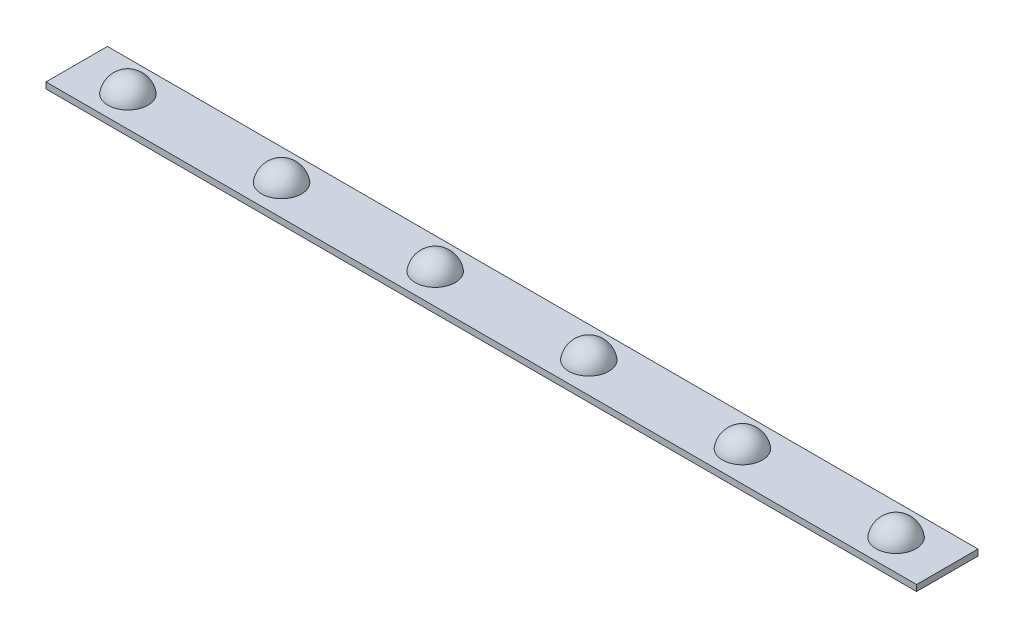
ISO-10303-21;
HEADER;
FILE_DESCRIPTION(('STEP AP214'),'2;1');
FILE_NAME('part.step','',(''),(''),'','','');
FILE_SCHEMA(('AUTOMOTIVE_DESIGN { 1 0 10303 214 1 1 1 1 }'));
ENDSEC;
DATA;
#1=APPLICATION_CONTEXT('core data for automotive mechanical design processes');
#2=APPLICATION_PROTOCOL_DEFINITION('international standard','automotive_design',2000,#1);
#3=PRODUCT_CONTEXT('',#1,'mechanical');
#4=PRODUCT('Part','Part','',(#3));
#5=PRODUCT_RELATED_PRODUCT_CATEGORY('part','',(#4));
#6=PRODUCT_DEFINITION_FORMATION('','',#4);
#7=PRODUCT_DEFINITION_CONTEXT('part definition',#1,'design');
#8=PRODUCT_DEFINITION('design','',#6,#7);
#9=PRODUCT_DEFINITION_SHAPE('','',#8);
#10=(LENGTH_UNIT() NAMED_UNIT(*) SI_UNIT(.MILLI.,.METRE.));
#11=(NAMED_UNIT(*) PLANE_ANGLE_UNIT() SI_UNIT($,.RADIAN.));
#12=(NAMED_UNIT(*) SI_UNIT($,.STERADIAN.) SOLID_ANGLE_UNIT());
#13=UNCERTAINTY_MEASURE_WITH_UNIT(LENGTH_MEASURE(1.E-05),#10,'distance_accuracy_value','');
#14=(GEOMETRIC_REPRESENTATION_CONTEXT(3) GLOBAL_UNCERTAINTY_ASSIGNED_CONTEXT((#13)) GLOBAL_UNIT_ASSIGNED_CONTEXT((#10,
#11,#12)) REPRESENTATION_CONTEXT('',''));
#15=CARTESIAN_POINT('',(0.,0.,0.));
#16=DIRECTION('',(0.,0.,1.));
#17=DIRECTION('',(1.,0.,0.));
#18=AXIS2_PLACEMENT_3D('',#15,#16,#17);
#19=CARTESIAN_POINT('',(-187.325,19.1743717494883,0.1524));
#20=DIRECTION('',(0.,1.,0.));
#21=DIRECTION('',(0.,0.,1.));
#22=AXIS2_PLACEMENT_3D('',#19,#20,#21);
#23=SPHERICAL_SURFACE('',#22,2.50880067106193);
#24=CARTESIAN_POINT('',(-187.325,19.5553717494883,0.1524));
#25=DIRECTION('',(0.,-1.,0.));
#26=DIRECTION('',(0.,0.,-1.));
#27=AXIS2_PLACEMENT_3D('',#24,#25,#26);
#28=CIRCLE('',#27,2.47970155605887);
#29=CARTESIAN_POINT('',(-187.325,19.5553717494883,-2.32730155605887));
#30=VERTEX_POINT('',#29);
#31=EDGE_CURVE('E120',#30,#30,#28,.T.);
#32=ORIENTED_EDGE('',*,*,#31,.F.);
#33=EDGE_LOOP('',(#32));
#34=FACE_BOUND('',#33,.T.);
#35=ADVANCED_FACE('F36',(#34),#23,.T.);
#36=CARTESIAN_POINT('',(-193.675,18.7933717494883,3.9624));
#37=DIRECTION('',(0.,0.,-1.));
#38=DIRECTION('',(0.,1.,0.));
#39=AXIS2_PLACEMENT_3D('',#36,#37,#38);
#40=PLANE('',#39);
#41=DIRECTION('',(1.,0.,0.));
#42=VECTOR('',#41,1.);
#43=CARTESIAN_POINT('',(-193.675,18.7933717494883,3.9624));
#44=LINE('',#43,#42);
#45=CARTESIAN_POINT('',(-193.675,18.7933717494883,3.9624));
#46=VERTEX_POINT('',#45);
#47=CARTESIAN_POINT('',(-85.725,18.7933717494883,3.9624));
#48=VERTEX_POINT('',#47);
#49=EDGE_CURVE('E100',#46,#48,#44,.T.);
#50=ORIENTED_EDGE('',*,*,#49,.T.);
#51=DIRECTION('',(0.,1.,0.));
#52=VECTOR('',#51,1.);
#53=CARTESIAN_POINT('',(-85.725,18.7933717494883,3.9624));
#54=LINE('',#53,#52);
#55=CARTESIAN_POINT('',(-85.725,19.5553717494883,3.9624));
#56=VERTEX_POINT('',#55);
#57=EDGE_CURVE('E94',#48,#56,#54,.T.);
#58=ORIENTED_EDGE('',*,*,#57,.T.);
#59=DIRECTION('',(1.,0.,0.));
#60=VECTOR('',#59,1.);
#61=CARTESIAN_POINT('',(-193.675,19.5553717494883,3.9624));
#62=LINE('',#61,#60);
#63=CARTESIAN_POINT('',(-193.675,19.5553717494883,3.9624));
#64=VERTEX_POINT('',#63);
#65=EDGE_CURVE('E77',#64,#56,#62,.T.);
#66=ORIENTED_EDGE('',*,*,#65,.F.);
#67=DIRECTION('',(0.,1.,0.));
#68=VECTOR('',#67,1.);
#69=CARTESIAN_POINT('',(-193.675,18.7933717494883,3.9624));
#70=LINE('',#69,#68);
#71=EDGE_CURVE('E109',#46,#64,#70,.T.);
#72=ORIENTED_EDGE('',*,*,#71,.F.);
#73=EDGE_LOOP('',(#50,#58,#66,#72));
#74=FACE_BOUND('',#73,.T.);
#75=ADVANCED_FACE('F99',(#74),#40,.F.);
#76=CARTESIAN_POINT('',(-193.675,19.5553717494883,3.9624));
#77=DIRECTION('',(0.,-1.,0.));
#78=DIRECTION('',(0.,0.,-1.));
#79=AXIS2_PLACEMENT_3D('',#76,#77,#78);
#80=PLANE('',#79);
#81=CARTESIAN_POINT('',(-92.075,19.5553717494883,0.1524));
#82=DIRECTION('',(0.,-1.,0.));
#83=DIRECTION('',(0.,0.,-1.));
#84=AXIS2_PLACEMENT_3D('',#81,#82,#83);
#85=CIRCLE('',#84,2.47970155605887);
#86=CARTESIAN_POINT('',(-92.075,19.5553717494883,-2.32730155605887));
#87=VERTEX_POINT('',#86);
#88=EDGE_CURVE('E11',#87,#87,#85,.F.);
#89=ORIENTED_EDGE('',*,*,#88,.F.);
#90=EDGE_LOOP('',(#89));
#91=FACE_BOUND('',#90,.T.);
#92=CARTESIAN_POINT('',(-111.125,19.5553717494883,0.1524));
#93=DIRECTION('',(0.,-1.,0.));
#94=DIRECTION('',(0.,0.,-1.));
#95=AXIS2_PLACEMENT_3D('',#92,#93,#94);
#96=CIRCLE('',#95,2.47970155605887);
#97=CARTESIAN_POINT('',(-111.125,19.5553717494883,-2.32730155605887));
#98=VERTEX_POINT('',#97);
#99=EDGE_CURVE('E135',#98,#98,#96,.F.);
#100=ORIENTED_EDGE('',*,*,#99,.F.);
#101=EDGE_LOOP('',(#100));
#102=FACE_BOUND('',#101,.T.);
#103=CARTESIAN_POINT('',(-130.175,19.5553717494883,0.1524));
#104=DIRECTION('',(0.,-1.,0.));
#105=DIRECTION('',(0.,0.,-1.));
#106=AXIS2_PLACEMENT_3D('',#103,#104,#105);
#107=CIRCLE('',#106,2.47970155605887);
#108=CARTESIAN_POINT('',(-130.175,19.5553717494883,-2.32730155605887));
#109=VERTEX_POINT('',#108);
#110=EDGE_CURVE('E132',#109,#109,#107,.F.);
#111=ORIENTED_EDGE('',*,*,#110,.F.);
#112=EDGE_LOOP('',(#111));
#113=FACE_BOUND('',#112,.T.);
#114=CARTESIAN_POINT('',(-149.225,19.5553717494883,0.1524));
#115=DIRECTION('',(0.,-1.,0.));
#116=DIRECTION('',(0.,0.,-1.));
#117=AXIS2_PLACEMENT_3D('',#114,#115,#116);
#118=CIRCLE('',#117,2.47970155605887);
#119=CARTESIAN_POINT('',(-149.225,19.5553717494883,-2.32730155605887));
#120=VERTEX_POINT('',#119);
#121=EDGE_CURVE('E129',#120,#120,#118,.F.);
#122=ORIENTED_EDGE('',*,*,#121,.F.);
#123=EDGE_LOOP('',(#122));
#124=FACE_BOUND('',#123,.T.);
#125=CARTESIAN_POINT('',(-168.275,19.5553717494883,0.1524));
#126=DIRECTION('',(0.,-1.,0.));
#127=DIRECTION('',(0.,0.,-1.));
#128=AXIS2_PLACEMENT_3D('',#125,#126,#127);
#129=CIRCLE('',#128,2.47970155605887);
#130=CARTESIAN_POINT('',(-168.275,19.5553717494883,-2.32730155605887));
#131=VERTEX_POINT('',#130);
#132=EDGE_CURVE('E103',#131,#131,#129,.F.);
#133=ORIENTED_EDGE('',*,*,#132,.F.);
#134=EDGE_LOOP('',(#133));
#135=FACE_BOUND('',#134,.T.);
#136=ORIENTED_EDGE('',*,*,#31,.T.);
#137=EDGE_LOOP('',(#136));
#138=FACE_BOUND('',#137,.T.);
#139=ORIENTED_EDGE('',*,*,#65,.T.);
#140=DIRECTION('',(0.,0.,-1.));
#141=VECTOR('',#140,1.);
#142=CARTESIAN_POINT('',(-85.725,19.5553717494883,3.9624));
#143=LINE('',#142,#141);
#144=CARTESIAN_POINT('',(-85.725,19.5553717494883,-3.6576));
#145=VERTEX_POINT('',#144);
#146=EDGE_CURVE('E81',#56,#145,#143,.T.);
#147=ORIENTED_EDGE('',*,*,#146,.T.);
#148=DIRECTION('',(1.,0.,0.));
#149=VECTOR('',#148,1.);
#150=CARTESIAN_POINT('',(-193.675,19.5553717494883,-3.6576));
#151=LINE('',#150,#149);
#152=CARTESIAN_POINT('',(-193.675,19.5553717494883,-3.6576));
#153=VERTEX_POINT('',#152);
#154=EDGE_CURVE('E87',#153,#145,#151,.T.);
#155=ORIENTED_EDGE('',*,*,#154,.F.);
#156=DIRECTION('',(0.,0.,-1.));
#157=VECTOR('',#156,1.);
#158=CARTESIAN_POINT('',(-193.675,19.5553717494883,3.9624));
#159=LINE('',#158,#157);
#160=EDGE_CURVE('E82',#64,#153,#159,.T.);
#161=ORIENTED_EDGE('',*,*,#160,.F.);
#162=EDGE_LOOP('',(#139,#147,#155,#161));
#163=FACE_BOUND('',#162,.T.);
#164=ADVANCED_FACE('F79',(#91,#102,#113,#124,#135,#138,#163),#80,.F.);
#165=CARTESIAN_POINT('',(-193.675,18.7933717494883,-3.6576));
#166=DIRECTION('',(0.,0.,1.));
#167=DIRECTION('',(1.,0.,0.));
#168=AXIS2_PLACEMENT_3D('',#165,#166,#167);
#169=PLANE('',#168);
#170=ORIENTED_EDGE('',*,*,#154,.T.);
#171=DIRECTION('',(0.,-1.,0.));
#172=VECTOR('',#171,1.);
#173=CARTESIAN_POINT('',(-85.725,18.7933717494883,-3.6576));
#174=LINE('',#173,#172);
#175=CARTESIAN_POINT('',(-85.725,18.7933717494883,-3.6576));
#176=VERTEX_POINT('',#175);
#177=EDGE_CURVE('E97',#145,#176,#174,.T.);
#178=ORIENTED_EDGE('',*,*,#177,.T.);
#179=DIRECTION('',(1.,0.,0.));
#180=VECTOR('',#179,1.);
#181=CARTESIAN_POINT('',(-193.675,18.7933717494883,-3.6576));
#182=LINE('',#181,#180);
#183=CARTESIAN_POINT('',(-193.675,18.7933717494883,-3.6576));
#184=VERTEX_POINT('',#183);
#185=EDGE_CURVE('E115',#184,#176,#182,.T.);
#186=ORIENTED_EDGE('',*,*,#185,.F.);
#187=DIRECTION('',(0.,-1.,0.));
#188=VECTOR('',#187,1.);
#189=CARTESIAN_POINT('',(-193.675,18.7933717494883,-3.6576));
#190=LINE('',#189,#188);
#191=EDGE_CURVE('E56',#153,#184,#190,.T.);
#192=ORIENTED_EDGE('',*,*,#191,.F.);
#193=EDGE_LOOP('',(#170,#178,#186,#192));
#194=FACE_BOUND('',#193,.T.);
#195=ADVANCED_FACE('F151',(#194),#169,.F.);
#196=CARTESIAN_POINT('',(-193.675,18.7933717494883,3.9624));
#197=DIRECTION('',(0.,1.,0.));
#198=DIRECTION('',(0.,0.,1.));
#199=AXIS2_PLACEMENT_3D('',#196,#197,#198);
#200=PLANE('',#199);
#201=CARTESIAN_POINT('',(-92.075,18.7933717494883,0.1524));
#202=DIRECTION('',(0.,1.,0.));
#203=DIRECTION('',(0.,0.,1.));
#204=AXIS2_PLACEMENT_3D('',#201,#202,#203);
#205=CIRCLE('',#204,2.47970155605887);
#206=CARTESIAN_POINT('',(-92.075,18.7933717494883,2.63210155605887));
#207=VERTEX_POINT('',#206);
#208=EDGE_CURVE('E39',#207,#207,#205,.F.);
#209=ORIENTED_EDGE('',*,*,#208,.F.);
#210=EDGE_LOOP('',(#209));
#211=FACE_BOUND('',#210,.T.);
#212=CARTESIAN_POINT('',(-111.125,18.7933717494883,0.1524));
#213=DIRECTION('',(0.,1.,0.));
#214=DIRECTION('',(0.,0.,1.));
#215=AXIS2_PLACEMENT_3D('',#212,#213,#214);
#216=CIRCLE('',#215,2.47970155605887);
#217=CARTESIAN_POINT('',(-111.125,18.7933717494883,2.63210155605887));
#218=VERTEX_POINT('',#217);
#219=EDGE_CURVE('E133',#218,#218,#216,.F.);
#220=ORIENTED_EDGE('',*,*,#219,.F.);
#221=EDGE_LOOP('',(#220));
#222=FACE_BOUND('',#221,.T.);
#223=CARTESIAN_POINT('',(-130.175,18.7933717494883,0.1524));
#224=DIRECTION('',(0.,1.,0.));
#225=DIRECTION('',(0.,0.,1.));
#226=AXIS2_PLACEMENT_3D('',#223,#224,#225);
#227=CIRCLE('',#226,2.47970155605887);
#228=CARTESIAN_POINT('',(-130.175,18.7933717494883,2.63210155605887));
#229=VERTEX_POINT('',#228);
#230=EDGE_CURVE('E130',#229,#229,#227,.F.);
#231=ORIENTED_EDGE('',*,*,#230,.F.);
#232=EDGE_LOOP('',(#231));
#233=FACE_BOUND('',#232,.T.);
#234=CARTESIAN_POINT('',(-149.225,18.7933717494883,0.1524));
#235=DIRECTION('',(0.,1.,0.));
#236=DIRECTION('',(0.,0.,1.));
#237=AXIS2_PLACEMENT_3D('',#234,#235,#236);
#238=CIRCLE('',#237,2.47970155605887);
#239=CARTESIAN_POINT('',(-149.225,18.7933717494883,2.63210155605887));
#240=VERTEX_POINT('',#239);
#241=EDGE_CURVE('E126',#240,#240,#238,.F.);
#242=ORIENTED_EDGE('',*,*,#241,.F.);
#243=EDGE_LOOP('',(#242));
#244=FACE_BOUND('',#243,.T.);
#245=CARTESIAN_POINT('',(-168.275,18.7933717494883,0.1524));
#246=DIRECTION('',(0.,1.,0.));
#247=DIRECTION('',(0.,0.,1.));
#248=AXIS2_PLACEMENT_3D('',#245,#246,#247);
#249=CIRCLE('',#248,2.47970155605887);
#250=CARTESIAN_POINT('',(-168.275,18.7933717494883,2.63210155605887));
#251=VERTEX_POINT('',#250);
#252=EDGE_CURVE('E123',#251,#251,#249,.F.);
#253=ORIENTED_EDGE('',*,*,#252,.F.);
#254=EDGE_LOOP('',(#253));
#255=FACE_BOUND('',#254,.T.);
#256=CARTESIAN_POINT('',(-187.325,18.7933717494883,0.1524));
#257=DIRECTION('',(0.,1.,0.));
#258=DIRECTION('',(0.,0.,1.));
#259=AXIS2_PLACEMENT_3D('',#256,#257,#258);
#260=CIRCLE('',#259,2.47970155605887);
#261=CARTESIAN_POINT('',(-187.325,18.7933717494883,2.63210155605887));
#262=VERTEX_POINT('',#261);
#263=EDGE_CURVE('E86',#262,#262,#260,.T.);
#264=ORIENTED_EDGE('',*,*,#263,.T.);
#265=EDGE_LOOP('',(#264));
#266=FACE_BOUND('',#265,.T.);
#267=ORIENTED_EDGE('',*,*,#185,.T.);
#268=DIRECTION('',(0.,0.,1.));
#269=VECTOR('',#268,1.);
#270=CARTESIAN_POINT('',(-85.725,18.7933717494883,3.9624));
#271=LINE('',#270,#269);
#272=EDGE_CURVE('E107',#176,#48,#271,.T.);
#273=ORIENTED_EDGE('',*,*,#272,.T.);
#274=ORIENTED_EDGE('',*,*,#49,.F.);
#275=DIRECTION('',(0.,0.,1.));
#276=VECTOR('',#275,1.);
#277=CARTESIAN_POINT('',(-193.675,18.7933717494883,3.9624));
#278=LINE('',#277,#276);
#279=EDGE_CURVE('E51',#184,#46,#278,.T.);
#280=ORIENTED_EDGE('',*,*,#279,.F.);
#281=EDGE_LOOP('',(#267,#273,#274,#280));
#282=FACE_BOUND('',#281,.T.);
#283=ADVANCED_FACE('F178',(#211,#222,#233,#244,#255,#266,#282),#200,.F.);
#284=CARTESIAN_POINT('',(-193.675,19.5553717494883,3.9624));
#285=DIRECTION('',(-1.,0.,0.));
#286=DIRECTION('',(0.,0.,1.));
#287=AXIS2_PLACEMENT_3D('',#284,#285,#286);
#288=PLANE('',#287);
#289=ORIENTED_EDGE('',*,*,#71,.T.);
#290=ORIENTED_EDGE('',*,*,#160,.T.);
#291=ORIENTED_EDGE('',*,*,#191,.T.);
#292=ORIENTED_EDGE('',*,*,#279,.T.);
#293=EDGE_LOOP('',(#289,#290,#291,#292));
#294=FACE_BOUND('',#293,.T.);
#295=ADVANCED_FACE('F174',(#294),#288,.T.);
#296=CARTESIAN_POINT('',(-85.725,19.5553717494883,3.9624));
#297=DIRECTION('',(-1.,0.,0.));
#298=DIRECTION('',(0.,0.,1.));
#299=AXIS2_PLACEMENT_3D('',#296,#297,#298);
#300=PLANE('',#299);
#301=ORIENTED_EDGE('',*,*,#57,.F.);
#302=ORIENTED_EDGE('',*,*,#272,.F.);
#303=ORIENTED_EDGE('',*,*,#177,.F.);
#304=ORIENTED_EDGE('',*,*,#146,.F.);
#305=EDGE_LOOP('',(#301,#302,#303,#304));
#306=FACE_BOUND('',#305,.T.);
#307=ADVANCED_FACE('F92',(#306),#300,.F.);
#308=ORIENTED_EDGE('',*,*,#263,.F.);
#309=EDGE_LOOP('',(#308));
#310=FACE_BOUND('',#309,.T.);
#311=ADVANCED_FACE('F160',(#310),#23,.T.);
#312=CARTESIAN_POINT('',(-168.275,19.1743717494883,0.1524));
#313=DIRECTION('',(0.,1.,0.));
#314=DIRECTION('',(0.,0.,1.));
#315=AXIS2_PLACEMENT_3D('',#312,#313,#314);
#316=SPHERICAL_SURFACE('',#315,2.50880067106193);
#317=ORIENTED_EDGE('',*,*,#252,.T.);
#318=EDGE_LOOP('',(#317));
#319=FACE_BOUND('',#318,.T.);
#320=ADVANCED_FACE('F165',(#319),#316,.T.);
#321=ORIENTED_EDGE('',*,*,#132,.T.);
#322=EDGE_LOOP('',(#321));
#323=FACE_BOUND('',#322,.T.);
#324=ADVANCED_FACE('F171',(#323),#316,.T.);
#325=CARTESIAN_POINT('',(-149.225,19.1743717494883,0.1524));
#326=DIRECTION('',(0.,1.,0.));
#327=DIRECTION('',(0.,0.,1.));
#328=AXIS2_PLACEMENT_3D('',#325,#326,#327);
#329=SPHERICAL_SURFACE('',#328,2.50880067106193);
#330=ORIENTED_EDGE('',*,*,#241,.T.);
#331=EDGE_LOOP('',(#330));
#332=FACE_BOUND('',#331,.T.);
#333=ADVANCED_FACE('F192',(#332),#329,.T.);
#334=ORIENTED_EDGE('',*,*,#121,.T.);
#335=EDGE_LOOP('',(#334));
#336=FACE_BOUND('',#335,.T.);
#337=ADVANCED_FACE('F147',(#336),#329,.T.);
#338=CARTESIAN_POINT('',(-130.175,19.1743717494883,0.1524));
#339=DIRECTION('',(0.,1.,0.));
#340=DIRECTION('',(0.,0.,1.));
#341=AXIS2_PLACEMENT_3D('',#338,#339,#340);
#342=SPHERICAL_SURFACE('',#341,2.50880067106193);
#343=ORIENTED_EDGE('',*,*,#230,.T.);
#344=EDGE_LOOP('',(#343));
#345=FACE_BOUND('',#344,.T.);
#346=ADVANCED_FACE('F196',(#345),#342,.T.);
#347=ORIENTED_EDGE('',*,*,#110,.T.);
#348=EDGE_LOOP('',(#347));
#349=FACE_BOUND('',#348,.T.);
#350=ADVANCED_FACE('F197',(#349),#342,.T.);
#351=CARTESIAN_POINT('',(-111.125,19.1743717494883,0.1524));
#352=DIRECTION('',(0.,1.,0.));
#353=DIRECTION('',(0.,0.,1.));
#354=AXIS2_PLACEMENT_3D('',#351,#352,#353);
#355=SPHERICAL_SURFACE('',#354,2.50880067106193);
#356=ORIENTED_EDGE('',*,*,#219,.T.);
#357=EDGE_LOOP('',(#356));
#358=FACE_BOUND('',#357,.T.);
#359=ADVANCED_FACE('F200',(#358),#355,.T.);
#360=ORIENTED_EDGE('',*,*,#99,.T.);
#361=EDGE_LOOP('',(#360));
#362=FACE_BOUND('',#361,.T.);
#363=ADVANCED_FACE('F201',(#362),#355,.T.);
#364=CARTESIAN_POINT('',(-92.075,19.1743717494883,0.1524));
#365=DIRECTION('',(0.,1.,0.));
#366=DIRECTION('',(0.,0.,1.));
#367=AXIS2_PLACEMENT_3D('',#364,#365,#366);
#368=SPHERICAL_SURFACE('',#367,2.50880067106193);
#369=ORIENTED_EDGE('',*,*,#208,.T.);
#370=EDGE_LOOP('',(#369));
#371=FACE_BOUND('',#370,.T.);
#372=ADVANCED_FACE('F204',(#371),#368,.T.);
#373=ORIENTED_EDGE('',*,*,#88,.T.);
#374=EDGE_LOOP('',(#373));
#375=FACE_BOUND('',#374,.T.);
#376=ADVANCED_FACE('F206',(#375),#368,.T.);
#377=CLOSED_SHELL('',(#35,#75,#164,#195,#283,#295,#307,#311,#320,#324,#333,#337,#346,#350,#359,
#363,#372,#376));
#378=MANIFOLD_SOLID_BREP('B2',#377);
#379=ADVANCED_BREP_SHAPE_REPRESENTATION('',(#18,#378),#14);
#380=SHAPE_DEFINITION_REPRESENTATION(#9,#379);
ENDSEC;
END-ISO-10303-21;
